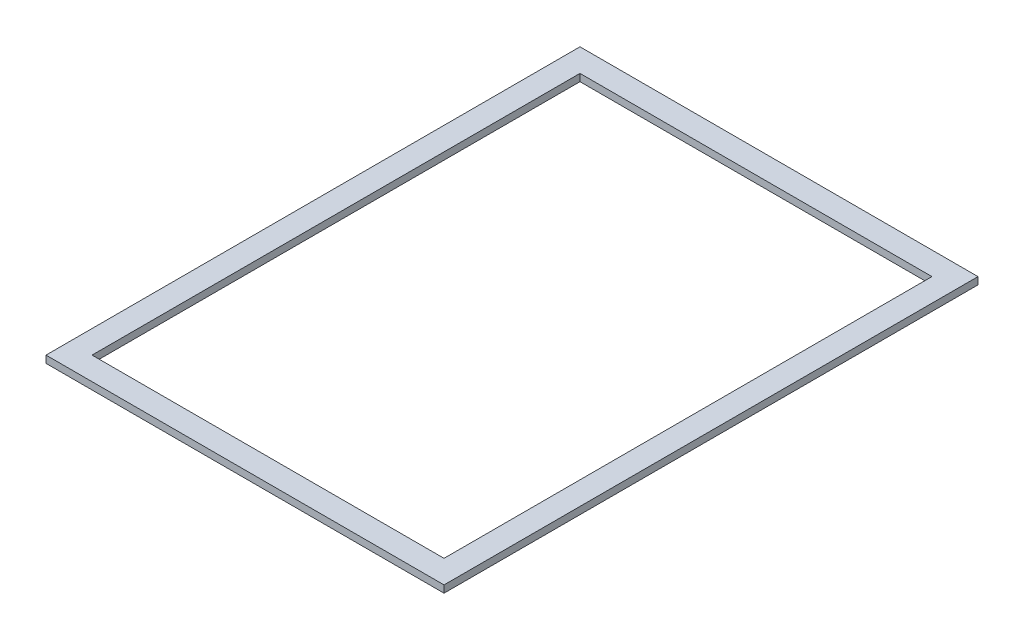
ISO-10303-21;
HEADER;
FILE_DESCRIPTION(('STEP AP214'),'2;1');
FILE_NAME('part.step','',(''),(''),'','','');
FILE_SCHEMA(('AUTOMOTIVE_DESIGN { 1 0 10303 214 1 1 1 1 }'));
ENDSEC;
DATA;
#1=APPLICATION_CONTEXT('core data for automotive mechanical design processes');
#2=APPLICATION_PROTOCOL_DEFINITION('international standard','automotive_design',2000,#1);
#3=PRODUCT_CONTEXT('',#1,'mechanical');
#4=PRODUCT('Part','Part','',(#3));
#5=PRODUCT_RELATED_PRODUCT_CATEGORY('part','',(#4));
#6=PRODUCT_DEFINITION_FORMATION('','',#4);
#7=PRODUCT_DEFINITION_CONTEXT('part definition',#1,'design');
#8=PRODUCT_DEFINITION('design','',#6,#7);
#9=PRODUCT_DEFINITION_SHAPE('','',#8);
#10=(LENGTH_UNIT() NAMED_UNIT(*) SI_UNIT(.MILLI.,.METRE.));
#11=(NAMED_UNIT(*) PLANE_ANGLE_UNIT() SI_UNIT($,.RADIAN.));
#12=(NAMED_UNIT(*) SI_UNIT($,.STERADIAN.) SOLID_ANGLE_UNIT());
#13=UNCERTAINTY_MEASURE_WITH_UNIT(LENGTH_MEASURE(1.E-05),#10,'distance_accuracy_value','');
#14=(GEOMETRIC_REPRESENTATION_CONTEXT(3) GLOBAL_UNCERTAINTY_ASSIGNED_CONTEXT((#13)) GLOBAL_UNIT_ASSIGNED_CONTEXT((#10,
#11,#12)) REPRESENTATION_CONTEXT('',''));
#15=CARTESIAN_POINT('',(0.,0.,0.));
#16=DIRECTION('',(0.,0.,1.));
#17=DIRECTION('',(1.,0.,0.));
#18=AXIS2_PLACEMENT_3D('',#15,#16,#17);
#19=CARTESIAN_POINT('',(0.,130.6195,0.));
#20=DIRECTION('',(0.,1.,0.));
#21=DIRECTION('',(0.,0.,1.));
#22=AXIS2_PLACEMENT_3D('',#19,#20,#21);
#23=PLANE('',#22);
#24=DIRECTION('',(0.,0.,1.));
#25=VECTOR('',#24,1.);
#26=CARTESIAN_POINT('',(0.,130.6195,-117.828));
#27=LINE('',#26,#25);
#28=CARTESIAN_POINT('',(0.,130.6195,-117.828));
#29=VERTEX_POINT('',#28);
#30=CARTESIAN_POINT('',(0.,130.6195,0.));
#31=VERTEX_POINT('',#30);
#32=EDGE_CURVE('E134',#29,#31,#27,.T.);
#33=ORIENTED_EDGE('',*,*,#32,.T.);
#34=DIRECTION('',(1.,0.,0.));
#35=VECTOR('',#34,1.);
#36=CARTESIAN_POINT('',(0.,130.6195,0.));
#37=LINE('',#36,#35);
#38=CARTESIAN_POINT('',(87.828,130.6195,0.));
#39=VERTEX_POINT('',#38);
#40=EDGE_CURVE('E137',#31,#39,#37,.T.);
#41=ORIENTED_EDGE('',*,*,#40,.T.);
#42=DIRECTION('',(0.,0.,-1.));
#43=VECTOR('',#42,1.);
#44=CARTESIAN_POINT('',(87.828,130.6195,-117.828));
#45=LINE('',#44,#43);
#46=CARTESIAN_POINT('',(87.828,130.6195,-117.828));
#47=VERTEX_POINT('',#46);
#48=EDGE_CURVE('E140',#39,#47,#45,.T.);
#49=ORIENTED_EDGE('',*,*,#48,.T.);
#50=DIRECTION('',(-1.,0.,0.));
#51=VECTOR('',#50,1.);
#52=CARTESIAN_POINT('',(0.,130.6195,-117.828));
#53=LINE('',#52,#51);
#54=EDGE_CURVE('E142',#47,#29,#53,.T.);
#55=ORIENTED_EDGE('',*,*,#54,.T.);
#56=EDGE_LOOP('',(#33,#41,#49,#55));
#57=FACE_BOUND('',#56,.T.);
#58=DIRECTION('',(0.,0.,1.));
#59=VECTOR('',#58,1.);
#60=CARTESIAN_POINT('',(5.08,130.6195,-112.748));
#61=LINE('',#60,#59);
#62=CARTESIAN_POINT('',(5.08,130.6195,-112.748));
#63=VERTEX_POINT('',#62);
#64=CARTESIAN_POINT('',(5.08,130.6195,-5.08));
#65=VERTEX_POINT('',#64);
#66=EDGE_CURVE('E106',#63,#65,#61,.T.);
#67=ORIENTED_EDGE('',*,*,#66,.F.);
#68=DIRECTION('',(-1.,0.,0.));
#69=VECTOR('',#68,1.);
#70=CARTESIAN_POINT('',(5.08,130.6195,-112.748));
#71=LINE('',#70,#69);
#72=CARTESIAN_POINT('',(82.748,130.6195,-112.748));
#73=VERTEX_POINT('',#72);
#74=EDGE_CURVE('E98',#73,#63,#71,.T.);
#75=ORIENTED_EDGE('',*,*,#74,.F.);
#76=DIRECTION('',(0.,0.,-1.));
#77=VECTOR('',#76,1.);
#78=CARTESIAN_POINT('',(82.748,130.6195,-112.748));
#79=LINE('',#78,#77);
#80=CARTESIAN_POINT('',(82.748,130.6195,-5.08));
#81=VERTEX_POINT('',#80);
#82=EDGE_CURVE('E120',#81,#73,#79,.T.);
#83=ORIENTED_EDGE('',*,*,#82,.F.);
#84=DIRECTION('',(1.,0.,0.));
#85=VECTOR('',#84,1.);
#86=CARTESIAN_POINT('',(5.08,130.6195,-5.08));
#87=LINE('',#86,#85);
#88=EDGE_CURVE('E118',#65,#81,#87,.T.);
#89=ORIENTED_EDGE('',*,*,#88,.F.);
#90=EDGE_LOOP('',(#67,#75,#83,#89));
#91=FACE_BOUND('',#90,.T.);
#92=ADVANCED_FACE('F33',(#57,#91),#23,.T.);
#93=CARTESIAN_POINT('',(0.,129.032,0.));
#94=DIRECTION('',(0.,1.,0.));
#95=DIRECTION('',(0.,0.,1.));
#96=AXIS2_PLACEMENT_3D('',#93,#94,#95);
#97=PLANE('',#96);
#98=DIRECTION('',(0.,0.,1.));
#99=VECTOR('',#98,1.);
#100=CARTESIAN_POINT('',(0.,129.032,-117.828));
#101=LINE('',#100,#99);
#102=CARTESIAN_POINT('',(0.,129.032,-117.828));
#103=VERTEX_POINT('',#102);
#104=CARTESIAN_POINT('',(0.,129.032,0.));
#105=VERTEX_POINT('',#104);
#106=EDGE_CURVE('E114',#103,#105,#101,.T.);
#107=ORIENTED_EDGE('',*,*,#106,.F.);
#108=DIRECTION('',(-1.,0.,0.));
#109=VECTOR('',#108,1.);
#110=CARTESIAN_POINT('',(0.,129.032,-117.828));
#111=LINE('',#110,#109);
#112=CARTESIAN_POINT('',(87.828,129.032,-117.828));
#113=VERTEX_POINT('',#112);
#114=EDGE_CURVE('E138',#113,#103,#111,.T.);
#115=ORIENTED_EDGE('',*,*,#114,.F.);
#116=DIRECTION('',(0.,0.,-1.));
#117=VECTOR('',#116,1.);
#118=CARTESIAN_POINT('',(87.828,129.032,-117.828));
#119=LINE('',#118,#117);
#120=CARTESIAN_POINT('',(87.828,129.032,0.));
#121=VERTEX_POINT('',#120);
#122=EDGE_CURVE('E149',#121,#113,#119,.T.);
#123=ORIENTED_EDGE('',*,*,#122,.F.);
#124=DIRECTION('',(1.,0.,0.));
#125=VECTOR('',#124,1.);
#126=CARTESIAN_POINT('',(0.,129.032,0.));
#127=LINE('',#126,#125);
#128=EDGE_CURVE('E147',#105,#121,#127,.T.);
#129=ORIENTED_EDGE('',*,*,#128,.F.);
#130=EDGE_LOOP('',(#107,#115,#123,#129));
#131=FACE_BOUND('',#130,.T.);
#132=DIRECTION('',(-1.,0.,0.));
#133=VECTOR('',#132,1.);
#134=CARTESIAN_POINT('',(5.08,129.032,-112.748));
#135=LINE('',#134,#133);
#136=CARTESIAN_POINT('',(82.748,129.032,-112.748));
#137=VERTEX_POINT('',#136);
#138=CARTESIAN_POINT('',(5.08,129.032,-112.748));
#139=VERTEX_POINT('',#138);
#140=EDGE_CURVE('E56',#137,#139,#135,.T.);
#141=ORIENTED_EDGE('',*,*,#140,.T.);
#142=DIRECTION('',(0.,0.,1.));
#143=VECTOR('',#142,1.);
#144=CARTESIAN_POINT('',(5.08,129.032,-112.748));
#145=LINE('',#144,#143);
#146=CARTESIAN_POINT('',(5.08,129.032,-5.08));
#147=VERTEX_POINT('',#146);
#148=EDGE_CURVE('E113',#139,#147,#145,.T.);
#149=ORIENTED_EDGE('',*,*,#148,.T.);
#150=DIRECTION('',(1.,0.,0.));
#151=VECTOR('',#150,1.);
#152=CARTESIAN_POINT('',(5.08,129.032,-5.08));
#153=LINE('',#152,#151);
#154=CARTESIAN_POINT('',(82.748,129.032,-5.08));
#155=VERTEX_POINT('',#154);
#156=EDGE_CURVE('E126',#147,#155,#153,.T.);
#157=ORIENTED_EDGE('',*,*,#156,.T.);
#158=DIRECTION('',(0.,0.,-1.));
#159=VECTOR('',#158,1.);
#160=CARTESIAN_POINT('',(82.748,129.032,-112.748));
#161=LINE('',#160,#159);
#162=EDGE_CURVE('E107',#155,#137,#161,.T.);
#163=ORIENTED_EDGE('',*,*,#162,.T.);
#164=EDGE_LOOP('',(#141,#149,#157,#163));
#165=FACE_BOUND('',#164,.T.);
#166=ADVANCED_FACE('F167',(#131,#165),#97,.F.);
#167=CARTESIAN_POINT('',(0.,130.6195,-117.828));
#168=DIRECTION('',(1.,0.,0.));
#169=DIRECTION('',(0.,0.,-1.));
#170=AXIS2_PLACEMENT_3D('',#167,#168,#169);
#171=PLANE('',#170);
#172=ORIENTED_EDGE('',*,*,#106,.T.);
#173=DIRECTION('',(0.,-1.,0.));
#174=VECTOR('',#173,1.);
#175=CARTESIAN_POINT('',(0.,130.6195,0.));
#176=LINE('',#175,#174);
#177=EDGE_CURVE('E11',#31,#105,#176,.T.);
#178=ORIENTED_EDGE('',*,*,#177,.F.);
#179=ORIENTED_EDGE('',*,*,#32,.F.);
#180=DIRECTION('',(0.,-1.,0.));
#181=VECTOR('',#180,1.);
#182=CARTESIAN_POINT('',(0.,130.6195,-117.828));
#183=LINE('',#182,#181);
#184=EDGE_CURVE('E144',#29,#103,#183,.T.);
#185=ORIENTED_EDGE('',*,*,#184,.T.);
#186=EDGE_LOOP('',(#172,#178,#179,#185));
#187=FACE_BOUND('',#186,.T.);
#188=ADVANCED_FACE('F35',(#187),#171,.F.);
#189=CARTESIAN_POINT('',(0.,130.6195,0.));
#190=DIRECTION('',(0.,0.,-1.));
#191=DIRECTION('',(-1.,0.,0.));
#192=AXIS2_PLACEMENT_3D('',#189,#190,#191);
#193=PLANE('',#192);
#194=ORIENTED_EDGE('',*,*,#128,.T.);
#195=DIRECTION('',(0.,-1.,0.));
#196=VECTOR('',#195,1.);
#197=CARTESIAN_POINT('',(87.828,130.6195,0.));
#198=LINE('',#197,#196);
#199=EDGE_CURVE('E41',#39,#121,#198,.T.);
#200=ORIENTED_EDGE('',*,*,#199,.F.);
#201=ORIENTED_EDGE('',*,*,#40,.F.);
#202=ORIENTED_EDGE('',*,*,#177,.T.);
#203=EDGE_LOOP('',(#194,#200,#201,#202));
#204=FACE_BOUND('',#203,.T.);
#205=ADVANCED_FACE('F177',(#204),#193,.F.);
#206=CARTESIAN_POINT('',(87.828,130.6195,-117.828));
#207=DIRECTION('',(-1.,0.,0.));
#208=DIRECTION('',(0.,0.,1.));
#209=AXIS2_PLACEMENT_3D('',#206,#207,#208);
#210=PLANE('',#209);
#211=ORIENTED_EDGE('',*,*,#122,.T.);
#212=DIRECTION('',(0.,-1.,0.));
#213=VECTOR('',#212,1.);
#214=CARTESIAN_POINT('',(87.828,130.6195,-117.828));
#215=LINE('',#214,#213);
#216=EDGE_CURVE('E154',#47,#113,#215,.T.);
#217=ORIENTED_EDGE('',*,*,#216,.F.);
#218=ORIENTED_EDGE('',*,*,#48,.F.);
#219=ORIENTED_EDGE('',*,*,#199,.T.);
#220=EDGE_LOOP('',(#211,#217,#218,#219));
#221=FACE_BOUND('',#220,.T.);
#222=ADVANCED_FACE('F161',(#221),#210,.F.);
#223=CARTESIAN_POINT('',(0.,130.6195,-117.828));
#224=DIRECTION('',(0.,0.,1.));
#225=DIRECTION('',(1.,0.,0.));
#226=AXIS2_PLACEMENT_3D('',#223,#224,#225);
#227=PLANE('',#226);
#228=ORIENTED_EDGE('',*,*,#114,.T.);
#229=ORIENTED_EDGE('',*,*,#184,.F.);
#230=ORIENTED_EDGE('',*,*,#54,.F.);
#231=ORIENTED_EDGE('',*,*,#216,.T.);
#232=EDGE_LOOP('',(#228,#229,#230,#231));
#233=FACE_BOUND('',#232,.T.);
#234=ADVANCED_FACE('F171',(#233),#227,.F.);
#235=CARTESIAN_POINT('',(5.08,130.6195,-112.748));
#236=DIRECTION('',(0.,0.,1.));
#237=DIRECTION('',(1.,0.,0.));
#238=AXIS2_PLACEMENT_3D('',#235,#236,#237);
#239=PLANE('',#238);
#240=ORIENTED_EDGE('',*,*,#140,.F.);
#241=DIRECTION('',(0.,-1.,0.));
#242=VECTOR('',#241,1.);
#243=CARTESIAN_POINT('',(82.748,130.6195,-112.748));
#244=LINE('',#243,#242);
#245=EDGE_CURVE('E102',#73,#137,#244,.T.);
#246=ORIENTED_EDGE('',*,*,#245,.F.);
#247=ORIENTED_EDGE('',*,*,#74,.T.);
#248=DIRECTION('',(0.,-1.,0.));
#249=VECTOR('',#248,1.);
#250=CARTESIAN_POINT('',(5.08,130.6195,-112.748));
#251=LINE('',#250,#249);
#252=EDGE_CURVE('E101',#63,#139,#251,.T.);
#253=ORIENTED_EDGE('',*,*,#252,.T.);
#254=EDGE_LOOP('',(#240,#246,#247,#253));
#255=FACE_BOUND('',#254,.T.);
#256=ADVANCED_FACE('F100',(#255),#239,.T.);
#257=CARTESIAN_POINT('',(5.08,130.6195,-112.748));
#258=DIRECTION('',(1.,0.,0.));
#259=DIRECTION('',(0.,0.,-1.));
#260=AXIS2_PLACEMENT_3D('',#257,#258,#259);
#261=PLANE('',#260);
#262=ORIENTED_EDGE('',*,*,#148,.F.);
#263=ORIENTED_EDGE('',*,*,#252,.F.);
#264=ORIENTED_EDGE('',*,*,#66,.T.);
#265=DIRECTION('',(0.,-1.,0.));
#266=VECTOR('',#265,1.);
#267=CARTESIAN_POINT('',(5.08,130.6195,-5.08));
#268=LINE('',#267,#266);
#269=EDGE_CURVE('E115',#65,#147,#268,.T.);
#270=ORIENTED_EDGE('',*,*,#269,.T.);
#271=EDGE_LOOP('',(#262,#263,#264,#270));
#272=FACE_BOUND('',#271,.T.);
#273=ADVANCED_FACE('F110',(#272),#261,.T.);
#274=CARTESIAN_POINT('',(5.08,130.6195,-5.08));
#275=DIRECTION('',(0.,0.,-1.));
#276=DIRECTION('',(-1.,0.,0.));
#277=AXIS2_PLACEMENT_3D('',#274,#275,#276);
#278=PLANE('',#277);
#279=ORIENTED_EDGE('',*,*,#156,.F.);
#280=ORIENTED_EDGE('',*,*,#269,.F.);
#281=ORIENTED_EDGE('',*,*,#88,.T.);
#282=DIRECTION('',(0.,-1.,0.));
#283=VECTOR('',#282,1.);
#284=CARTESIAN_POINT('',(82.748,130.6195,-5.08));
#285=LINE('',#284,#283);
#286=EDGE_CURVE('E48',#81,#155,#285,.T.);
#287=ORIENTED_EDGE('',*,*,#286,.T.);
#288=EDGE_LOOP('',(#279,#280,#281,#287));
#289=FACE_BOUND('',#288,.T.);
#290=ADVANCED_FACE('F200',(#289),#278,.T.);
#291=CARTESIAN_POINT('',(82.748,130.6195,-112.748));
#292=DIRECTION('',(-1.,0.,0.));
#293=DIRECTION('',(0.,0.,1.));
#294=AXIS2_PLACEMENT_3D('',#291,#292,#293);
#295=PLANE('',#294);
#296=ORIENTED_EDGE('',*,*,#162,.F.);
#297=ORIENTED_EDGE('',*,*,#286,.F.);
#298=ORIENTED_EDGE('',*,*,#82,.T.);
#299=ORIENTED_EDGE('',*,*,#245,.T.);
#300=EDGE_LOOP('',(#296,#297,#298,#299));
#301=FACE_BOUND('',#300,.T.);
#302=ADVANCED_FACE('F204',(#301),#295,.T.);
#303=CLOSED_SHELL('',(#92,#166,#188,#205,#222,#234,#256,#273,#290,#302));
#304=MANIFOLD_SOLID_BREP('B2',#303);
#305=ADVANCED_BREP_SHAPE_REPRESENTATION('',(#18,#304),#14);
#306=SHAPE_DEFINITION_REPRESENTATION(#9,#305);
ENDSEC;
END-ISO-10303-21;
